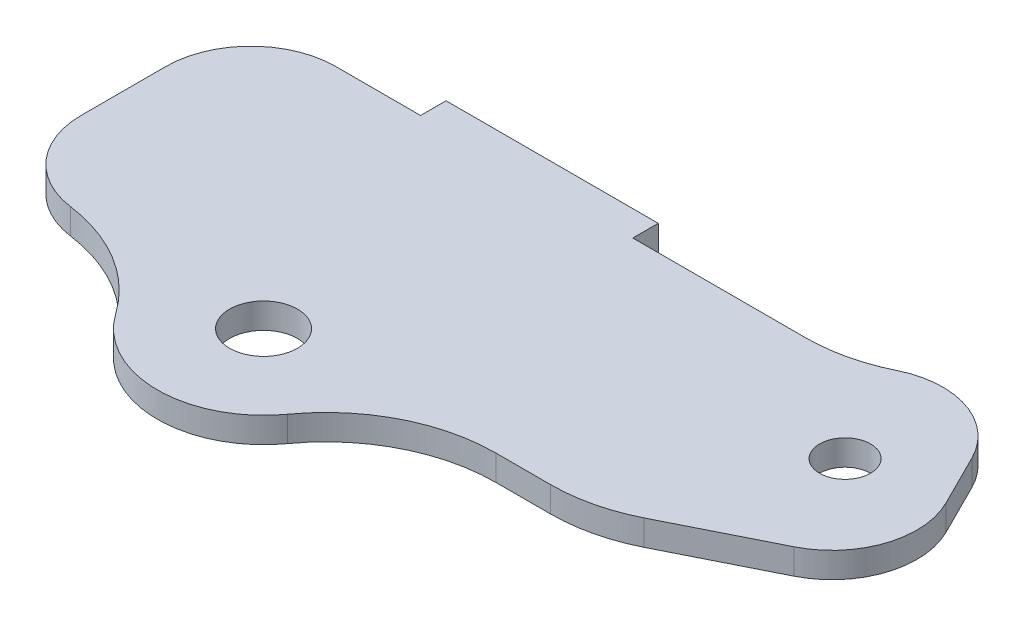
ISO-10303-21;
HEADER;
FILE_DESCRIPTION(('STEP AP214'),'2;1');
FILE_NAME('part.step','',(''),(''),'','','');
FILE_SCHEMA(('AUTOMOTIVE_DESIGN { 1 0 10303 214 1 1 1 1 }'));
ENDSEC;
DATA;
#1=APPLICATION_CONTEXT('core data for automotive mechanical design processes');
#2=APPLICATION_PROTOCOL_DEFINITION('international standard','automotive_design',2000,#1);
#3=PRODUCT_CONTEXT('',#1,'mechanical');
#4=PRODUCT('Part','Part','',(#3));
#5=PRODUCT_RELATED_PRODUCT_CATEGORY('part','',(#4));
#6=PRODUCT_DEFINITION_FORMATION('','',#4);
#7=PRODUCT_DEFINITION_CONTEXT('part definition',#1,'design');
#8=PRODUCT_DEFINITION('design','',#6,#7);
#9=PRODUCT_DEFINITION_SHAPE('','',#8);
#10=(LENGTH_UNIT() NAMED_UNIT(*) SI_UNIT(.MILLI.,.METRE.));
#11=(NAMED_UNIT(*) PLANE_ANGLE_UNIT() SI_UNIT($,.RADIAN.));
#12=(NAMED_UNIT(*) SI_UNIT($,.STERADIAN.) SOLID_ANGLE_UNIT());
#13=UNCERTAINTY_MEASURE_WITH_UNIT(LENGTH_MEASURE(1.E-05),#10,'distance_accuracy_value','');
#14=(GEOMETRIC_REPRESENTATION_CONTEXT(3) GLOBAL_UNCERTAINTY_ASSIGNED_CONTEXT((#13)) GLOBAL_UNIT_ASSIGNED_CONTEXT((#10,
#11,#12)) REPRESENTATION_CONTEXT('',''));
#15=CARTESIAN_POINT('',(0.,0.,0.));
#16=DIRECTION('',(0.,0.,1.));
#17=DIRECTION('',(1.,0.,0.));
#18=AXIS2_PLACEMENT_3D('',#15,#16,#17);
#19=CARTESIAN_POINT('',(0.,3.,-15.));
#20=DIRECTION('',(0.,0.,-1.));
#21=DIRECTION('',(-1.,0.,0.));
#22=AXIS2_PLACEMENT_3D('',#19,#20,#21);
#23=PLANE('',#22);
#24=DIRECTION('',(1.,0.,0.));
#25=VECTOR('',#24,1.);
#26=CARTESIAN_POINT('',(0.,3.,-15.));
#27=LINE('',#26,#25);
#28=CARTESIAN_POINT('',(10.,3.,-15.));
#29=VERTEX_POINT('',#28);
#30=CARTESIAN_POINT('',(30.2809945623819,3.,-15.));
#31=VERTEX_POINT('',#30);
#32=EDGE_CURVE('E163',#29,#31,#27,.T.);
#33=ORIENTED_EDGE('',*,*,#32,.T.);
#34=DIRECTION('',(0.,1.,0.));
#35=VECTOR('',#34,1.);
#36=CARTESIAN_POINT('',(30.2809945623819,0.,-15.));
#37=LINE('',#36,#35);
#38=CARTESIAN_POINT('',(30.2809945623819,0.,-15.));
#39=VERTEX_POINT('',#38);
#40=EDGE_CURVE('E301',#31,#39,#37,.F.);
#41=ORIENTED_EDGE('',*,*,#40,.T.);
#42=DIRECTION('',(1.,0.,0.));
#43=VECTOR('',#42,1.);
#44=CARTESIAN_POINT('',(0.,0.,-15.));
#45=LINE('',#44,#43);
#46=CARTESIAN_POINT('',(10.,0.,-15.));
#47=VERTEX_POINT('',#46);
#48=EDGE_CURVE('E166',#47,#39,#45,.T.);
#49=ORIENTED_EDGE('',*,*,#48,.F.);
#50=DIRECTION('',(0.,-1.,0.));
#51=VECTOR('',#50,1.);
#52=CARTESIAN_POINT('',(10.,3.,-15.));
#53=LINE('',#52,#51);
#54=EDGE_CURVE('E160',#29,#47,#53,.T.);
#55=ORIENTED_EDGE('',*,*,#54,.F.);
#56=EDGE_LOOP('',(#33,#41,#49,#55));
#57=FACE_BOUND('',#56,.T.);
#58=ADVANCED_FACE('F35',(#57),#23,.T.);
#59=CARTESIAN_POINT('',(10.,3.,0.));
#60=DIRECTION('',(-1.,0.,0.));
#61=DIRECTION('',(0.,0.,1.));
#62=AXIS2_PLACEMENT_3D('',#59,#60,#61);
#63=PLANE('',#62);
#64=DIRECTION('',(0.,0.,-1.));
#65=VECTOR('',#64,1.);
#66=CARTESIAN_POINT('',(10.,0.,0.));
#67=LINE('',#66,#65);
#68=CARTESIAN_POINT('',(10.,0.,-18.));
#69=VERTEX_POINT('',#68);
#70=EDGE_CURVE('E222',#47,#69,#67,.T.);
#71=ORIENTED_EDGE('',*,*,#70,.T.);
#72=DIRECTION('',(0.,-1.,0.));
#73=VECTOR('',#72,1.);
#74=CARTESIAN_POINT('',(10.,3.,-18.));
#75=LINE('',#74,#73);
#76=CARTESIAN_POINT('',(10.,3.,-18.));
#77=VERTEX_POINT('',#76);
#78=EDGE_CURVE('E171',#77,#69,#75,.T.);
#79=ORIENTED_EDGE('',*,*,#78,.F.);
#80=DIRECTION('',(0.,0.,-1.));
#81=VECTOR('',#80,1.);
#82=CARTESIAN_POINT('',(10.,3.,0.));
#83=LINE('',#82,#81);
#84=EDGE_CURVE('E174',#29,#77,#83,.T.);
#85=ORIENTED_EDGE('',*,*,#84,.F.);
#86=ORIENTED_EDGE('',*,*,#54,.T.);
#87=EDGE_LOOP('',(#71,#79,#85,#86));
#88=FACE_BOUND('',#87,.T.);
#89=ADVANCED_FACE('F175',(#88),#63,.F.);
#90=CARTESIAN_POINT('',(0.,3.,-18.));
#91=DIRECTION('',(0.,0.,-1.));
#92=DIRECTION('',(-1.,0.,0.));
#93=AXIS2_PLACEMENT_3D('',#90,#91,#92);
#94=PLANE('',#93);
#95=DIRECTION('',(1.,0.,0.));
#96=VECTOR('',#95,1.);
#97=CARTESIAN_POINT('',(0.,0.,-18.));
#98=LINE('',#97,#96);
#99=CARTESIAN_POINT('',(-15.,0.,-18.));
#100=VERTEX_POINT('',#99);
#101=EDGE_CURVE('E225',#100,#69,#98,.T.);
#102=ORIENTED_EDGE('',*,*,#101,.F.);
#103=DIRECTION('',(0.,-1.,0.));
#104=VECTOR('',#103,1.);
#105=CARTESIAN_POINT('',(-15.,3.,-18.));
#106=LINE('',#105,#104);
#107=CARTESIAN_POINT('',(-15.,3.,-18.));
#108=VERTEX_POINT('',#107);
#109=EDGE_CURVE('E249',#108,#100,#106,.T.);
#110=ORIENTED_EDGE('',*,*,#109,.F.);
#111=DIRECTION('',(1.,0.,0.));
#112=VECTOR('',#111,1.);
#113=CARTESIAN_POINT('',(0.,3.,-18.));
#114=LINE('',#113,#112);
#115=EDGE_CURVE('E178',#108,#77,#114,.T.);
#116=ORIENTED_EDGE('',*,*,#115,.T.);
#117=ORIENTED_EDGE('',*,*,#78,.T.);
#118=EDGE_LOOP('',(#102,#110,#116,#117));
#119=FACE_BOUND('',#118,.T.);
#120=ADVANCED_FACE('F331',(#119),#94,.T.);
#121=CARTESIAN_POINT('',(-15.,3.,0.));
#122=DIRECTION('',(-1.,0.,0.));
#123=DIRECTION('',(0.,0.,1.));
#124=AXIS2_PLACEMENT_3D('',#121,#122,#123);
#125=PLANE('',#124);
#126=DIRECTION('',(0.,0.,-1.));
#127=VECTOR('',#126,1.);
#128=CARTESIAN_POINT('',(-15.,0.,0.));
#129=LINE('',#128,#127);
#130=CARTESIAN_POINT('',(-15.,0.,-15.));
#131=VERTEX_POINT('',#130);
#132=EDGE_CURVE('E228',#131,#100,#129,.T.);
#133=ORIENTED_EDGE('',*,*,#132,.F.);
#134=DIRECTION('',(0.,-1.,0.));
#135=VECTOR('',#134,1.);
#136=CARTESIAN_POINT('',(-15.,3.,-15.));
#137=LINE('',#136,#135);
#138=CARTESIAN_POINT('',(-15.,3.,-15.));
#139=VERTEX_POINT('',#138);
#140=EDGE_CURVE('E220',#139,#131,#137,.T.);
#141=ORIENTED_EDGE('',*,*,#140,.F.);
#142=DIRECTION('',(0.,0.,-1.));
#143=VECTOR('',#142,1.);
#144=CARTESIAN_POINT('',(-15.,3.,0.));
#145=LINE('',#144,#143);
#146=EDGE_CURVE('E190',#139,#108,#145,.T.);
#147=ORIENTED_EDGE('',*,*,#146,.T.);
#148=ORIENTED_EDGE('',*,*,#109,.T.);
#149=EDGE_LOOP('',(#133,#141,#147,#148));
#150=FACE_BOUND('',#149,.T.);
#151=ADVANCED_FACE('F337',(#150),#125,.T.);
#152=CARTESIAN_POINT('',(-25.,0.,-15.));
#153=VERTEX_POINT('',#152);
#154=EDGE_CURVE('E223',#153,#131,#45,.T.);
#155=ORIENTED_EDGE('',*,*,#154,.F.);
#156=DIRECTION('',(0.,-1.,0.));
#157=VECTOR('',#156,1.);
#158=CARTESIAN_POINT('',(-25.,3.,-15.));
#159=LINE('',#158,#157);
#160=CARTESIAN_POINT('',(-25.,3.,-15.));
#161=VERTEX_POINT('',#160);
#162=EDGE_CURVE('E280',#153,#161,#159,.F.);
#163=ORIENTED_EDGE('',*,*,#162,.T.);
#164=EDGE_CURVE('E185',#161,#139,#27,.T.);
#165=ORIENTED_EDGE('',*,*,#164,.T.);
#166=ORIENTED_EDGE('',*,*,#140,.T.);
#167=EDGE_LOOP('',(#155,#163,#165,#166));
#168=FACE_BOUND('',#167,.T.);
#169=ADVANCED_FACE('F327',(#168),#23,.T.);
#170=CARTESIAN_POINT('',(-35.,3.,0.));
#171=DIRECTION('',(1.,0.,0.));
#172=DIRECTION('',(0.,0.,-1.));
#173=AXIS2_PLACEMENT_3D('',#170,#171,#172);
#174=PLANE('',#173);
#175=DIRECTION('',(0.,0.,1.));
#176=VECTOR('',#175,1.);
#177=CARTESIAN_POINT('',(-35.,0.,0.));
#178=LINE('',#177,#176);
#179=CARTESIAN_POINT('',(-35.,0.,-5.));
#180=VERTEX_POINT('',#179);
#181=CARTESIAN_POINT('',(-35.,0.,5.));
#182=VERTEX_POINT('',#181);
#183=EDGE_CURVE('E231',#180,#182,#178,.T.);
#184=ORIENTED_EDGE('',*,*,#183,.T.);
#185=DIRECTION('',(0.,-1.,0.));
#186=VECTOR('',#185,1.);
#187=CARTESIAN_POINT('',(-35.,3.,5.));
#188=LINE('',#187,#186);
#189=CARTESIAN_POINT('',(-35.,3.,5.));
#190=VERTEX_POINT('',#189);
#191=EDGE_CURVE('E278',#182,#190,#188,.F.);
#192=ORIENTED_EDGE('',*,*,#191,.T.);
#193=DIRECTION('',(0.,0.,1.));
#194=VECTOR('',#193,1.);
#195=CARTESIAN_POINT('',(-35.,3.,0.));
#196=LINE('',#195,#194);
#197=CARTESIAN_POINT('',(-35.,3.,-5.));
#198=VERTEX_POINT('',#197);
#199=EDGE_CURVE('E189',#198,#190,#196,.T.);
#200=ORIENTED_EDGE('',*,*,#199,.F.);
#201=DIRECTION('',(0.,-1.,0.));
#202=VECTOR('',#201,1.);
#203=CARTESIAN_POINT('',(-35.,0.,-5.));
#204=LINE('',#203,#202);
#205=EDGE_CURVE('E275',#198,#180,#204,.T.);
#206=ORIENTED_EDGE('',*,*,#205,.T.);
#207=EDGE_LOOP('',(#184,#192,#200,#206));
#208=FACE_BOUND('',#207,.T.);
#209=ADVANCED_FACE('F336',(#208),#174,.F.);
#210=CARTESIAN_POINT('',(-2.5,3.,16.));
#211=DIRECTION('',(0.,-1.,0.));
#212=DIRECTION('',(0.,0.,-1.));
#213=AXIS2_PLACEMENT_3D('',#210,#211,#212);
#214=CYLINDRICAL_SURFACE('',#213,12.5);
#215=CARTESIAN_POINT('',(-2.5,0.,16.));
#216=DIRECTION('',(0.,1.,0.));
#217=DIRECTION('',(0.,0.,1.));
#218=AXIS2_PLACEMENT_3D('',#215,#216,#217);
#219=CIRCLE('',#218,12.5);
#220=CARTESIAN_POINT('',(7.64138221033477,0.,23.3076923076923));
#221=VERTEX_POINT('',#220);
#222=CARTESIAN_POINT('',(-12.7172119449689,0.,23.2012901671566));
#223=VERTEX_POINT('',#222);
#224=EDGE_CURVE('E234',#221,#223,#219,.F.);
#225=ORIENTED_EDGE('',*,*,#224,.F.);
#226=DIRECTION('',(0.,-1.,0.));
#227=VECTOR('',#226,1.);
#228=CARTESIAN_POINT('',(7.64138221033477,3.,23.3076923076923));
#229=LINE('',#228,#227);
#230=CARTESIAN_POINT('',(7.64138221033477,3.,23.3076923076923));
#231=VERTEX_POINT('',#230);
#232=EDGE_CURVE('E290',#221,#231,#229,.F.);
#233=ORIENTED_EDGE('',*,*,#232,.T.);
#234=CARTESIAN_POINT('',(-2.5,3.,16.));
#235=DIRECTION('',(0.,1.,0.));
#236=DIRECTION('',(0.,0.,1.));
#237=AXIS2_PLACEMENT_3D('',#234,#235,#236);
#238=CIRCLE('',#237,12.5);
#239=CARTESIAN_POINT('',(-12.7172119449689,3.,23.2012901671566));
#240=VERTEX_POINT('',#239);
#241=EDGE_CURVE('E196',#231,#240,#238,.F.);
#242=ORIENTED_EDGE('',*,*,#241,.T.);
#243=DIRECTION('',(0.,-1.,0.));
#244=VECTOR('',#243,1.);
#245=CARTESIAN_POINT('',(-12.7172119449689,3.,23.2012901671566));
#246=LINE('',#245,#244);
#247=EDGE_CURVE('E287',#240,#223,#246,.T.);
#248=ORIENTED_EDGE('',*,*,#247,.T.);
#249=EDGE_LOOP('',(#225,#233,#242,#248));
#250=FACE_BOUND('',#249,.T.);
#251=ADVANCED_FACE('F342',(#250),#214,.T.);
#252=CARTESIAN_POINT('',(0.,3.,15.));
#253=DIRECTION('',(0.,0.,-1.));
#254=DIRECTION('',(-1.,0.,0.));
#255=AXIS2_PLACEMENT_3D('',#252,#253,#254);
#256=PLANE('',#255);
#257=DIRECTION('',(1.,0.,0.));
#258=VECTOR('',#257,1.);
#259=CARTESIAN_POINT('',(0.,3.,15.));
#260=LINE('',#259,#258);
#261=CARTESIAN_POINT('',(23.8675937468704,3.,15.));
#262=VERTEX_POINT('',#261);
#263=CARTESIAN_POINT('',(30.2786404500042,3.,15.));
#264=VERTEX_POINT('',#263);
#265=EDGE_CURVE('E204',#262,#264,#260,.T.);
#266=ORIENTED_EDGE('',*,*,#265,.F.);
#267=DIRECTION('',(0.,-1.,0.));
#268=VECTOR('',#267,1.);
#269=CARTESIAN_POINT('',(23.8675937468704,3.,15.));
#270=LINE('',#269,#268);
#271=CARTESIAN_POINT('',(23.8675937468704,0.,15.));
#272=VERTEX_POINT('',#271);
#273=EDGE_CURVE('E284',#262,#272,#270,.T.);
#274=ORIENTED_EDGE('',*,*,#273,.T.);
#275=DIRECTION('',(1.,0.,0.));
#276=VECTOR('',#275,1.);
#277=CARTESIAN_POINT('',(0.,0.,15.));
#278=LINE('',#277,#276);
#279=CARTESIAN_POINT('',(30.2786404500042,0.,15.));
#280=VERTEX_POINT('',#279);
#281=EDGE_CURVE('E235',#272,#280,#278,.T.);
#282=ORIENTED_EDGE('',*,*,#281,.T.);
#283=DIRECTION('',(0.,-1.,0.));
#284=VECTOR('',#283,1.);
#285=CARTESIAN_POINT('',(30.2786404500042,3.,15.));
#286=LINE('',#285,#284);
#287=EDGE_CURVE('E282',#280,#264,#286,.F.);
#288=ORIENTED_EDGE('',*,*,#287,.T.);
#289=EDGE_LOOP('',(#266,#274,#282,#288));
#290=FACE_BOUND('',#289,.T.);
#291=ADVANCED_FACE('F373',(#290),#256,.F.);
#292=CARTESIAN_POINT('',(13.,3.,26.));
#293=DIRECTION('',(0.447213595499958,0.,0.894427190999916));
#294=DIRECTION('',(0.894427190999916,0.,-0.447213595499958));
#295=AXIS2_PLACEMENT_3D('',#292,#293,#294);
#296=PLANE('',#295);
#297=DIRECTION('',(-0.894427190999916,0.,0.447213595499958));
#298=VECTOR('',#297,1.);
#299=CARTESIAN_POINT('',(13.,3.,26.));
#300=LINE('',#299,#298);
#301=CARTESIAN_POINT('',(51.,3.,6.99999999999999));
#302=VERTEX_POINT('',#301);
#303=CARTESIAN_POINT('',(39.2229123600034,3.,12.8885438199983));
#304=VERTEX_POINT('',#303);
#305=EDGE_CURVE('E206',#302,#304,#300,.T.);
#306=ORIENTED_EDGE('',*,*,#305,.T.);
#307=DIRECTION('',(0.,-1.,0.));
#308=VECTOR('',#307,1.);
#309=CARTESIAN_POINT('',(39.2229123600034,0.,12.8885438199983));
#310=LINE('',#309,#308);
#311=CARTESIAN_POINT('',(39.2229123600034,0.,12.8885438199983));
#312=VERTEX_POINT('',#311);
#313=EDGE_CURVE('E294',#304,#312,#310,.T.);
#314=ORIENTED_EDGE('',*,*,#313,.T.);
#315=DIRECTION('',(-0.894427190999916,0.,0.447213595499958));
#316=VECTOR('',#315,1.);
#317=CARTESIAN_POINT('',(13.,0.,26.));
#318=LINE('',#317,#316);
#319=CARTESIAN_POINT('',(51.,0.,6.99999999999999));
#320=VERTEX_POINT('',#319);
#321=EDGE_CURVE('E238',#320,#312,#318,.T.);
#322=ORIENTED_EDGE('',*,*,#321,.F.);
#323=DIRECTION('',(0.,-1.,0.));
#324=VECTOR('',#323,1.);
#325=CARTESIAN_POINT('',(51.,3.,6.99999999999999));
#326=LINE('',#325,#324);
#327=EDGE_CURVE('E264',#320,#302,#326,.F.);
#328=ORIENTED_EDGE('',*,*,#327,.T.);
#329=EDGE_LOOP('',(#306,#314,#322,#328));
#330=FACE_BOUND('',#329,.T.);
#331=ADVANCED_FACE('F380',(#330),#296,.T.);
#332=CARTESIAN_POINT('',(46.9442719099991,3.,-23.4721359549996));
#333=DIRECTION('',(0.894427190999916,0.,-0.447213595499958));
#334=DIRECTION('',(-0.447213595499958,0.,-0.894427190999916));
#335=AXIS2_PLACEMENT_3D('',#332,#333,#334);
#336=PLANE('',#335);
#337=DIRECTION('',(0.447213595499958,0.,0.894427190999916));
#338=VECTOR('',#337,1.);
#339=CARTESIAN_POINT('',(46.9442719099991,3.,-23.4721359549996));
#340=LINE('',#339,#338);
#341=CARTESIAN_POINT('',(52.4164078649987,3.,-12.5278640450004));
#342=VERTEX_POINT('',#341);
#343=CARTESIAN_POINT('',(55.4721359549996,3.,-6.41640786499875));
#344=VERTEX_POINT('',#343);
#345=EDGE_CURVE('E211',#342,#344,#340,.T.);
#346=ORIENTED_EDGE('',*,*,#345,.T.);
#347=DIRECTION('',(0.,-1.,0.));
#348=VECTOR('',#347,1.);
#349=CARTESIAN_POINT('',(55.4721359549996,3.,-6.41640786499875));
#350=LINE('',#349,#348);
#351=CARTESIAN_POINT('',(55.4721359549996,0.,-6.41640786499875));
#352=VERTEX_POINT('',#351);
#353=EDGE_CURVE('E253',#344,#352,#350,.T.);
#354=ORIENTED_EDGE('',*,*,#353,.T.);
#355=DIRECTION('',(0.447213595499958,0.,0.894427190999916));
#356=VECTOR('',#355,1.);
#357=CARTESIAN_POINT('',(46.9442719099991,0.,-23.4721359549996));
#358=LINE('',#357,#356);
#359=CARTESIAN_POINT('',(52.4164078649987,0.,-12.5278640450004));
#360=VERTEX_POINT('',#359);
#361=EDGE_CURVE('E243',#360,#352,#358,.T.);
#362=ORIENTED_EDGE('',*,*,#361,.F.);
#363=DIRECTION('',(0.,-1.,0.));
#364=VECTOR('',#363,1.);
#365=CARTESIAN_POINT('',(52.4164078649987,3.,-12.5278640450004));
#366=LINE('',#365,#364);
#367=EDGE_CURVE('E170',#360,#342,#366,.F.);
#368=ORIENTED_EDGE('',*,*,#367,.T.);
#369=EDGE_LOOP('',(#346,#354,#362,#368));
#370=FACE_BOUND('',#369,.T.);
#371=ADVANCED_FACE('F387',(#370),#336,.T.);
#372=CARTESIAN_POINT('',(-2.5,3.,16.));
#373=DIRECTION('',(0.,-1.,0.));
#374=DIRECTION('',(0.,0.,-1.));
#375=AXIS2_PLACEMENT_3D('',#372,#373,#374);
#376=CYLINDRICAL_SURFACE('',#375,4.);
#377=CARTESIAN_POINT('',(-2.5,3.,16.));
#378=DIRECTION('',(0.,1.,0.));
#379=DIRECTION('',(0.,0.,1.));
#380=AXIS2_PLACEMENT_3D('',#377,#378,#379);
#381=CIRCLE('',#380,4.);
#382=CARTESIAN_POINT('',(-2.5,3.,20.));
#383=VERTEX_POINT('',#382);
#384=EDGE_CURVE('E214',#383,#383,#381,.T.);
#385=ORIENTED_EDGE('',*,*,#384,.T.);
#386=EDGE_LOOP('',(#385));
#387=FACE_BOUND('',#386,.T.);
#388=CARTESIAN_POINT('',(-2.5,0.,16.));
#389=DIRECTION('',(0.,1.,0.));
#390=DIRECTION('',(0.,0.,1.));
#391=AXIS2_PLACEMENT_3D('',#388,#389,#390);
#392=CIRCLE('',#391,4.);
#393=CARTESIAN_POINT('',(-2.5,0.,20.));
#394=VERTEX_POINT('',#393);
#395=EDGE_CURVE('E187',#394,#394,#392,.T.);
#396=ORIENTED_EDGE('',*,*,#395,.F.);
#397=EDGE_LOOP('',(#396));
#398=FACE_BOUND('',#397,.T.);
#399=ADVANCED_FACE('F390',(#387,#398),#376,.F.);
#400=CARTESIAN_POINT('',(45.,3.,-5.));
#401=DIRECTION('',(0.,-1.,0.));
#402=DIRECTION('',(0.,0.,-1.));
#403=AXIS2_PLACEMENT_3D('',#400,#401,#402);
#404=CYLINDRICAL_SURFACE('',#403,3.);
#405=CARTESIAN_POINT('',(45.,3.,-5.));
#406=DIRECTION('',(0.,1.,0.));
#407=DIRECTION('',(0.,0.,1.));
#408=AXIS2_PLACEMENT_3D('',#405,#406,#407);
#409=CIRCLE('',#408,3.);
#410=CARTESIAN_POINT('',(45.,3.,-2.));
#411=VERTEX_POINT('',#410);
#412=EDGE_CURVE('E217',#411,#411,#409,.T.);
#413=ORIENTED_EDGE('',*,*,#412,.T.);
#414=EDGE_LOOP('',(#413));
#415=FACE_BOUND('',#414,.T.);
#416=CARTESIAN_POINT('',(45.,0.,-5.));
#417=DIRECTION('',(0.,1.,0.));
#418=DIRECTION('',(0.,0.,1.));
#419=AXIS2_PLACEMENT_3D('',#416,#417,#418);
#420=CIRCLE('',#419,3.);
#421=CARTESIAN_POINT('',(45.,0.,-2.));
#422=VERTEX_POINT('',#421);
#423=EDGE_CURVE('E183',#422,#422,#420,.T.);
#424=ORIENTED_EDGE('',*,*,#423,.F.);
#425=EDGE_LOOP('',(#424));
#426=FACE_BOUND('',#425,.T.);
#427=ADVANCED_FACE('F396',(#415,#426),#404,.F.);
#428=CARTESIAN_POINT('',(0.,3.,0.));
#429=DIRECTION('',(0.,1.,0.));
#430=DIRECTION('',(0.,0.,1.));
#431=AXIS2_PLACEMENT_3D('',#428,#429,#430);
#432=PLANE('',#431);
#433=ORIENTED_EDGE('',*,*,#265,.T.);
#434=CARTESIAN_POINT('',(30.2786404500042,3.,-5.));
#435=DIRECTION('',(0.,1.,0.));
#436=DIRECTION('',(0.,0.,1.));
#437=AXIS2_PLACEMENT_3D('',#434,#435,#436);
#438=CIRCLE('',#437,20.);
#439=EDGE_CURVE('E299',#264,#304,#438,.T.);
#440=ORIENTED_EDGE('',*,*,#439,.T.);
#441=ORIENTED_EDGE('',*,*,#305,.F.);
#442=CARTESIAN_POINT('',(46.5278640450004,3.,-1.94427190999917));
#443=DIRECTION('',(0.,1.,0.));
#444=DIRECTION('',(0.,0.,1.));
#445=AXIS2_PLACEMENT_3D('',#442,#443,#444);
#446=CIRCLE('',#445,10.);
#447=EDGE_CURVE('E273',#302,#344,#446,.T.);
#448=ORIENTED_EDGE('',*,*,#447,.T.);
#449=ORIENTED_EDGE('',*,*,#345,.F.);
#450=CARTESIAN_POINT('',(43.4721359549996,3.,-8.05572809000084));
#451=DIRECTION('',(0.,1.,0.));
#452=DIRECTION('',(0.,0.,1.));
#453=AXIS2_PLACEMENT_3D('',#450,#451,#452);
#454=CIRCLE('',#453,10.);
#455=CARTESIAN_POINT('',(39.075088824127,3.,-17.0371520600006));
#456=VERTEX_POINT('',#455);
#457=EDGE_CURVE('E271',#342,#456,#454,.T.);
#458=ORIENTED_EDGE('',*,*,#457,.T.);
#459=CARTESIAN_POINT('',(30.2809945623819,3.,-35.));
#460=DIRECTION('',(0.,1.,0.));
#461=DIRECTION('',(0.,0.,1.));
#462=AXIS2_PLACEMENT_3D('',#459,#460,#461);
#463=CIRCLE('',#462,20.);
#464=EDGE_CURVE('E11',#456,#31,#463,.F.);
#465=ORIENTED_EDGE('',*,*,#464,.T.);
#466=ORIENTED_EDGE('',*,*,#32,.F.);
#467=ORIENTED_EDGE('',*,*,#84,.T.);
#468=ORIENTED_EDGE('',*,*,#115,.F.);
#469=ORIENTED_EDGE('',*,*,#146,.F.);
#470=ORIENTED_EDGE('',*,*,#164,.F.);
#471=CARTESIAN_POINT('',(-25.,3.,-5.));
#472=DIRECTION('',(0.,1.,0.));
#473=DIRECTION('',(0.,0.,1.));
#474=AXIS2_PLACEMENT_3D('',#471,#472,#473);
#475=CIRCLE('',#474,10.);
#476=EDGE_CURVE('E266',#161,#198,#475,.T.);
#477=ORIENTED_EDGE('',*,*,#476,.T.);
#478=ORIENTED_EDGE('',*,*,#199,.T.);
#479=CARTESIAN_POINT('',(-25.,3.,5.));
#480=DIRECTION('',(0.,1.,0.));
#481=DIRECTION('',(0.,0.,1.));
#482=AXIS2_PLACEMENT_3D('',#479,#480,#481);
#483=CIRCLE('',#482,10.);
#484=CARTESIAN_POINT('',(-26.354917018973,3.,14.9077848115357));
#485=VERTEX_POINT('',#484);
#486=EDGE_CURVE('E268',#190,#485,#483,.T.);
#487=ORIENTED_EDGE('',*,*,#486,.T.);
#488=CARTESIAN_POINT('',(-29.064751056919,3.,34.7233544346071));
#489=DIRECTION('',(0.,1.,0.));
#490=DIRECTION('',(0.,0.,1.));
#491=AXIS2_PLACEMENT_3D('',#488,#489,#490);
#492=CIRCLE('',#491,20.);
#493=EDGE_CURVE('E310',#485,#240,#492,.F.);
#494=ORIENTED_EDGE('',*,*,#493,.T.);
#495=ORIENTED_EDGE('',*,*,#241,.F.);
#496=CARTESIAN_POINT('',(23.8675937468704,3.,35.));
#497=DIRECTION('',(0.,1.,0.));
#498=DIRECTION('',(0.,0.,1.));
#499=AXIS2_PLACEMENT_3D('',#496,#497,#498);
#500=CIRCLE('',#499,20.);
#501=EDGE_CURVE('E306',#231,#262,#500,.F.);
#502=ORIENTED_EDGE('',*,*,#501,.T.);
#503=EDGE_LOOP('',(#433,#440,#441,#448,#449,#458,#465,#466,#467,#468,#469,#470,#477,#478,#487,
#494,#495,#502));
#504=FACE_BOUND('',#503,.T.);
#505=ORIENTED_EDGE('',*,*,#384,.F.);
#506=EDGE_LOOP('',(#505));
#507=FACE_BOUND('',#506,.T.);
#508=ORIENTED_EDGE('',*,*,#412,.F.);
#509=EDGE_LOOP('',(#508));
#510=FACE_BOUND('',#509,.T.);
#511=ADVANCED_FACE('F181',(#504,#507,#510),#432,.T.);
#512=CARTESIAN_POINT('',(0.,0.,0.));
#513=DIRECTION('',(0.,1.,0.));
#514=DIRECTION('',(0.,0.,1.));
#515=AXIS2_PLACEMENT_3D('',#512,#513,#514);
#516=PLANE('',#515);
#517=ORIENTED_EDGE('',*,*,#321,.T.);
#518=CARTESIAN_POINT('',(30.2786404500042,0.,-5.));
#519=DIRECTION('',(0.,1.,0.));
#520=DIRECTION('',(0.,0.,1.));
#521=AXIS2_PLACEMENT_3D('',#518,#519,#520);
#522=CIRCLE('',#521,20.);
#523=EDGE_CURVE('E297',#312,#280,#522,.F.);
#524=ORIENTED_EDGE('',*,*,#523,.T.);
#525=ORIENTED_EDGE('',*,*,#281,.F.);
#526=CARTESIAN_POINT('',(23.8675937468704,0.,35.));
#527=DIRECTION('',(0.,1.,0.));
#528=DIRECTION('',(0.,0.,1.));
#529=AXIS2_PLACEMENT_3D('',#526,#527,#528);
#530=CIRCLE('',#529,20.);
#531=EDGE_CURVE('E304',#272,#221,#530,.T.);
#532=ORIENTED_EDGE('',*,*,#531,.T.);
#533=ORIENTED_EDGE('',*,*,#224,.T.);
#534=CARTESIAN_POINT('',(-29.064751056919,0.,34.7233544346071));
#535=DIRECTION('',(0.,1.,0.));
#536=DIRECTION('',(0.,0.,1.));
#537=AXIS2_PLACEMENT_3D('',#534,#535,#536);
#538=CIRCLE('',#537,20.);
#539=CARTESIAN_POINT('',(-26.354917018973,0.,14.9077848115357));
#540=VERTEX_POINT('',#539);
#541=EDGE_CURVE('E308',#223,#540,#538,.T.);
#542=ORIENTED_EDGE('',*,*,#541,.T.);
#543=CARTESIAN_POINT('',(-25.,0.,5.));
#544=DIRECTION('',(0.,1.,0.));
#545=DIRECTION('',(0.,0.,1.));
#546=AXIS2_PLACEMENT_3D('',#543,#544,#545);
#547=CIRCLE('',#546,10.);
#548=EDGE_CURVE('E258',#540,#182,#547,.F.);
#549=ORIENTED_EDGE('',*,*,#548,.T.);
#550=ORIENTED_EDGE('',*,*,#183,.F.);
#551=CARTESIAN_POINT('',(-25.,0.,-5.));
#552=DIRECTION('',(0.,1.,0.));
#553=DIRECTION('',(0.,0.,1.));
#554=AXIS2_PLACEMENT_3D('',#551,#552,#553);
#555=CIRCLE('',#554,10.);
#556=EDGE_CURVE('E256',#180,#153,#555,.F.);
#557=ORIENTED_EDGE('',*,*,#556,.T.);
#558=ORIENTED_EDGE('',*,*,#154,.T.);
#559=ORIENTED_EDGE('',*,*,#132,.T.);
#560=ORIENTED_EDGE('',*,*,#101,.T.);
#561=ORIENTED_EDGE('',*,*,#70,.F.);
#562=ORIENTED_EDGE('',*,*,#48,.T.);
#563=CARTESIAN_POINT('',(30.2809945623819,0.,-35.));
#564=DIRECTION('',(0.,1.,0.));
#565=DIRECTION('',(0.,0.,1.));
#566=AXIS2_PLACEMENT_3D('',#563,#564,#565);
#567=CIRCLE('',#566,20.);
#568=CARTESIAN_POINT('',(39.075088824127,0.,-17.0371520600006));
#569=VERTEX_POINT('',#568);
#570=EDGE_CURVE('E43',#39,#569,#567,.T.);
#571=ORIENTED_EDGE('',*,*,#570,.T.);
#572=CARTESIAN_POINT('',(43.4721359549996,0.,-8.05572809000084));
#573=DIRECTION('',(0.,1.,0.));
#574=DIRECTION('',(0.,0.,1.));
#575=AXIS2_PLACEMENT_3D('',#572,#573,#574);
#576=CIRCLE('',#575,10.);
#577=EDGE_CURVE('E260',#569,#360,#576,.F.);
#578=ORIENTED_EDGE('',*,*,#577,.T.);
#579=ORIENTED_EDGE('',*,*,#361,.T.);
#580=CARTESIAN_POINT('',(46.5278640450004,0.,-1.94427190999917));
#581=DIRECTION('',(0.,1.,0.));
#582=DIRECTION('',(0.,0.,1.));
#583=AXIS2_PLACEMENT_3D('',#580,#581,#582);
#584=CIRCLE('',#583,10.);
#585=EDGE_CURVE('E262',#352,#320,#584,.F.);
#586=ORIENTED_EDGE('',*,*,#585,.T.);
#587=EDGE_LOOP('',(#517,#524,#525,#532,#533,#542,#549,#550,#557,#558,#559,#560,#561,#562,#571,
#578,#579,#586));
#588=FACE_BOUND('',#587,.T.);
#589=ORIENTED_EDGE('',*,*,#395,.T.);
#590=EDGE_LOOP('',(#589));
#591=FACE_BOUND('',#590,.T.);
#592=ORIENTED_EDGE('',*,*,#423,.T.);
#593=EDGE_LOOP('',(#592));
#594=FACE_BOUND('',#593,.T.);
#595=ADVANCED_FACE('F312',(#588,#591,#594),#516,.F.);
#596=CARTESIAN_POINT('',(46.5278640450004,3.,-1.94427190999917));
#597=DIRECTION('',(0.,-1.,0.));
#598=DIRECTION('',(0.,0.,-1.));
#599=AXIS2_PLACEMENT_3D('',#596,#597,#598);
#600=CYLINDRICAL_SURFACE('',#599,10.);
#601=ORIENTED_EDGE('',*,*,#447,.F.);
#602=ORIENTED_EDGE('',*,*,#327,.F.);
#603=ORIENTED_EDGE('',*,*,#585,.F.);
#604=ORIENTED_EDGE('',*,*,#353,.F.);
#605=EDGE_LOOP('',(#601,#602,#603,#604));
#606=FACE_BOUND('',#605,.T.);
#607=ADVANCED_FACE('F385',(#606),#600,.T.);
#608=CARTESIAN_POINT('',(43.4721359549996,3.,-8.05572809000084));
#609=DIRECTION('',(0.,-1.,0.));
#610=DIRECTION('',(0.,0.,-1.));
#611=AXIS2_PLACEMENT_3D('',#608,#609,#610);
#612=CYLINDRICAL_SURFACE('',#611,10.);
#613=ORIENTED_EDGE('',*,*,#577,.F.);
#614=DIRECTION('',(0.,-1.,0.));
#615=VECTOR('',#614,1.);
#616=CARTESIAN_POINT('',(39.075088824127,3.,-17.0371520600006));
#617=LINE('',#616,#615);
#618=EDGE_CURVE('E56',#569,#456,#617,.F.);
#619=ORIENTED_EDGE('',*,*,#618,.T.);
#620=ORIENTED_EDGE('',*,*,#457,.F.);
#621=ORIENTED_EDGE('',*,*,#367,.F.);
#622=EDGE_LOOP('',(#613,#619,#620,#621));
#623=FACE_BOUND('',#622,.T.);
#624=ADVANCED_FACE('F317',(#623),#612,.T.);
#625=CARTESIAN_POINT('',(-25.,3.,5.));
#626=DIRECTION('',(0.,-1.,0.));
#627=DIRECTION('',(0.,0.,-1.));
#628=AXIS2_PLACEMENT_3D('',#625,#626,#627);
#629=CYLINDRICAL_SURFACE('',#628,10.);
#630=ORIENTED_EDGE('',*,*,#548,.F.);
#631=DIRECTION('',(0.,-1.,0.));
#632=VECTOR('',#631,1.);
#633=CARTESIAN_POINT('',(-26.354917018973,3.,14.9077848115357));
#634=LINE('',#633,#632);
#635=EDGE_CURVE('E292',#540,#485,#634,.F.);
#636=ORIENTED_EDGE('',*,*,#635,.T.);
#637=ORIENTED_EDGE('',*,*,#486,.F.);
#638=ORIENTED_EDGE('',*,*,#191,.F.);
#639=EDGE_LOOP('',(#630,#636,#637,#638));
#640=FACE_BOUND('',#639,.T.);
#641=ADVANCED_FACE('F357',(#640),#629,.T.);
#642=CARTESIAN_POINT('',(-25.,3.,-5.));
#643=DIRECTION('',(0.,1.,0.));
#644=DIRECTION('',(0.,0.,1.));
#645=AXIS2_PLACEMENT_3D('',#642,#643,#644);
#646=CYLINDRICAL_SURFACE('',#645,10.);
#647=ORIENTED_EDGE('',*,*,#476,.F.);
#648=ORIENTED_EDGE('',*,*,#162,.F.);
#649=ORIENTED_EDGE('',*,*,#556,.F.);
#650=ORIENTED_EDGE('',*,*,#205,.F.);
#651=EDGE_LOOP('',(#647,#648,#649,#650));
#652=FACE_BOUND('',#651,.T.);
#653=ADVANCED_FACE('F349',(#652),#646,.T.);
#654=CARTESIAN_POINT('',(23.8675937468704,3.,35.));
#655=DIRECTION('',(0.,-1.,0.));
#656=DIRECTION('',(0.,0.,-1.));
#657=AXIS2_PLACEMENT_3D('',#654,#655,#656);
#658=CYLINDRICAL_SURFACE('',#657,20.);
#659=ORIENTED_EDGE('',*,*,#501,.F.);
#660=ORIENTED_EDGE('',*,*,#232,.F.);
#661=ORIENTED_EDGE('',*,*,#531,.F.);
#662=ORIENTED_EDGE('',*,*,#273,.F.);
#663=EDGE_LOOP('',(#659,#660,#661,#662));
#664=FACE_BOUND('',#663,.T.);
#665=ADVANCED_FACE('F370',(#664),#658,.F.);
#666=CARTESIAN_POINT('',(-29.064751056919,3.,34.7233544346071));
#667=DIRECTION('',(0.,1.,0.));
#668=DIRECTION('',(0.,0.,1.));
#669=AXIS2_PLACEMENT_3D('',#666,#667,#668);
#670=CYLINDRICAL_SURFACE('',#669,20.);
#671=ORIENTED_EDGE('',*,*,#493,.F.);
#672=ORIENTED_EDGE('',*,*,#635,.F.);
#673=ORIENTED_EDGE('',*,*,#541,.F.);
#674=ORIENTED_EDGE('',*,*,#247,.F.);
#675=EDGE_LOOP('',(#671,#672,#673,#674));
#676=FACE_BOUND('',#675,.T.);
#677=ADVANCED_FACE('F323',(#676),#670,.F.);
#678=CARTESIAN_POINT('',(30.2786404500042,3.,-5.));
#679=DIRECTION('',(0.,1.,0.));
#680=DIRECTION('',(0.,0.,1.));
#681=AXIS2_PLACEMENT_3D('',#678,#679,#680);
#682=CYLINDRICAL_SURFACE('',#681,20.);
#683=ORIENTED_EDGE('',*,*,#439,.F.);
#684=ORIENTED_EDGE('',*,*,#287,.F.);
#685=ORIENTED_EDGE('',*,*,#523,.F.);
#686=ORIENTED_EDGE('',*,*,#313,.F.);
#687=EDGE_LOOP('',(#683,#684,#685,#686));
#688=FACE_BOUND('',#687,.T.);
#689=ADVANCED_FACE('F319',(#688),#682,.T.);
#690=CARTESIAN_POINT('',(30.2809945623819,3.,-35.));
#691=DIRECTION('',(0.,-1.,0.));
#692=DIRECTION('',(0.,0.,-1.));
#693=AXIS2_PLACEMENT_3D('',#690,#691,#692);
#694=CYLINDRICAL_SURFACE('',#693,20.);
#695=ORIENTED_EDGE('',*,*,#464,.F.);
#696=ORIENTED_EDGE('',*,*,#618,.F.);
#697=ORIENTED_EDGE('',*,*,#570,.F.);
#698=ORIENTED_EDGE('',*,*,#40,.F.);
#699=EDGE_LOOP('',(#695,#696,#697,#698));
#700=FACE_BOUND('',#699,.T.);
#701=ADVANCED_FACE('F37',(#700),#694,.F.);
#702=CLOSED_SHELL('',(#58,#89,#120,#151,#169,#209,#251,#291,#331,#371,#399,#427,#511,#595,#607,
#624,#641,#653,#665,#677,#689,#701));
#703=MANIFOLD_SOLID_BREP('B2',#702);
#704=ADVANCED_BREP_SHAPE_REPRESENTATION('',(#18,#703),#14);
#705=SHAPE_DEFINITION_REPRESENTATION(#9,#704);
ENDSEC;
END-ISO-10303-21;
